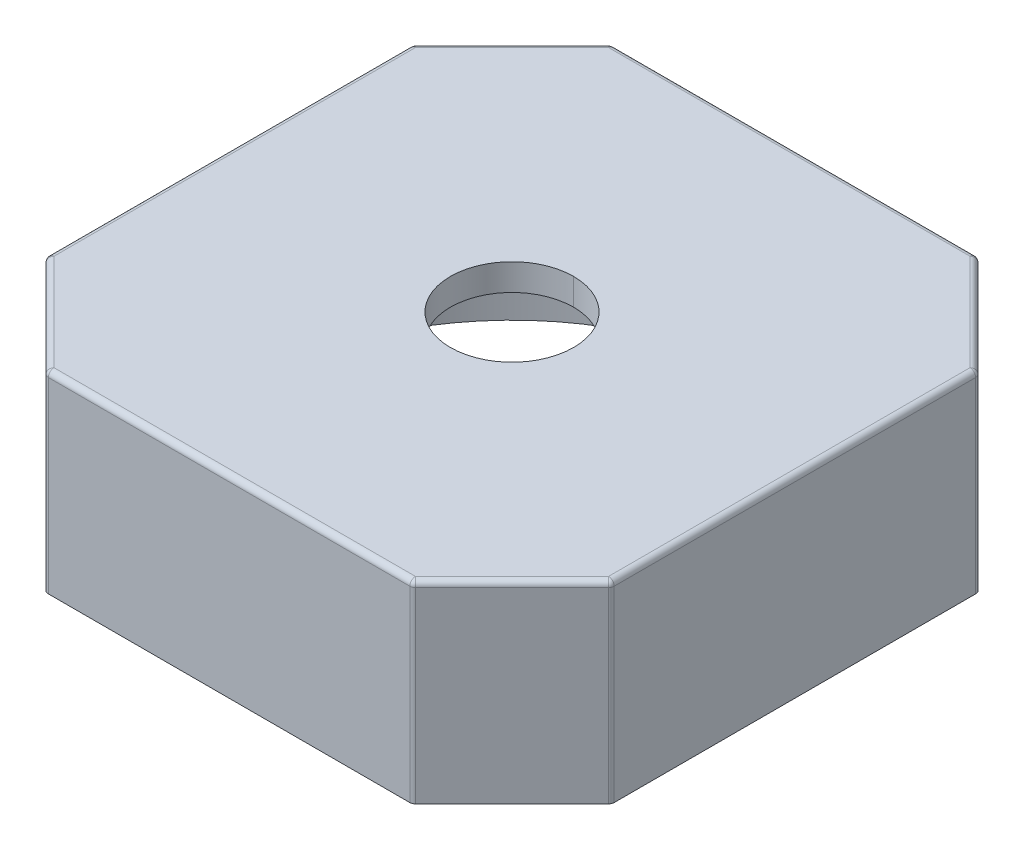
ISO-10303-21;
HEADER;
FILE_DESCRIPTION(('STEP AP214'),'2;1');
FILE_NAME('part.step','',(''),(''),'','','');
FILE_SCHEMA(('AUTOMOTIVE_DESIGN { 1 0 10303 214 1 1 1 1 }'));
ENDSEC;
DATA;
#1=APPLICATION_CONTEXT('core data for automotive mechanical design processes');
#2=APPLICATION_PROTOCOL_DEFINITION('international standard','automotive_design',2000,#1);
#3=PRODUCT_CONTEXT('',#1,'mechanical');
#4=PRODUCT('Part','Part','',(#3));
#5=PRODUCT_RELATED_PRODUCT_CATEGORY('part','',(#4));
#6=PRODUCT_DEFINITION_FORMATION('','',#4);
#7=PRODUCT_DEFINITION_CONTEXT('part definition',#1,'design');
#8=PRODUCT_DEFINITION('design','',#6,#7);
#9=PRODUCT_DEFINITION_SHAPE('','',#8);
#10=(LENGTH_UNIT() NAMED_UNIT(*) SI_UNIT(.MILLI.,.METRE.));
#11=(NAMED_UNIT(*) PLANE_ANGLE_UNIT() SI_UNIT($,.RADIAN.));
#12=(NAMED_UNIT(*) SI_UNIT($,.STERADIAN.) SOLID_ANGLE_UNIT());
#13=UNCERTAINTY_MEASURE_WITH_UNIT(LENGTH_MEASURE(1.E-05),#10,'distance_accuracy_value','');
#14=(GEOMETRIC_REPRESENTATION_CONTEXT(3) GLOBAL_UNCERTAINTY_ASSIGNED_CONTEXT((#13)) GLOBAL_UNIT_ASSIGNED_CONTEXT((#10,
#11,#12)) REPRESENTATION_CONTEXT('',''));
#15=CARTESIAN_POINT('',(0.,0.,0.));
#16=DIRECTION('',(0.,0.,1.));
#17=DIRECTION('',(1.,0.,0.));
#18=AXIS2_PLACEMENT_3D('',#15,#16,#17);
#19=CARTESIAN_POINT('',(0.,3.6,0.));
#20=DIRECTION('',(0.,-1.,0.));
#21=DIRECTION('',(1.,0.,0.));
#22=AXIS2_PLACEMENT_3D('',#19,#20,#21);
#23=CYLINDRICAL_SURFACE('',#22,3.95);
#24=CARTESIAN_POINT('',(0.,3.6,0.));
#25=DIRECTION('',(0.,-1.,0.));
#26=DIRECTION('',(1.,0.,0.));
#27=AXIS2_PLACEMENT_3D('',#24,#25,#26);
#28=CIRCLE('',#27,3.95);
#29=CARTESIAN_POINT('',(-3.95,3.6,0.));
#30=VERTEX_POINT('',#29);
#31=CARTESIAN_POINT('',(3.95,3.6,0.));
#32=VERTEX_POINT('',#31);
#33=EDGE_CURVE('E11',#30,#32,#28,.T.);
#34=ORIENTED_EDGE('',*,*,#33,.F.);
#35=DIRECTION('',(0.,-1.,0.));
#36=VECTOR('',#35,1.);
#37=CARTESIAN_POINT('',(-3.95,3.6,0.));
#38=LINE('',#37,#36);
#39=CARTESIAN_POINT('',(-3.95,1.1,0.));
#40=VERTEX_POINT('',#39);
#41=EDGE_CURVE('E24',#30,#40,#38,.T.);
#42=ORIENTED_EDGE('',*,*,#41,.T.);
#43=CARTESIAN_POINT('',(0.,1.1,0.));
#44=DIRECTION('',(0.,1.,0.));
#45=DIRECTION('',(1.,0.,0.));
#46=AXIS2_PLACEMENT_3D('',#43,#44,#45);
#47=CIRCLE('',#46,3.95);
#48=CARTESIAN_POINT('',(3.95,1.1,0.));
#49=VERTEX_POINT('',#48);
#50=EDGE_CURVE('E346',#49,#40,#47,.T.);
#51=ORIENTED_EDGE('',*,*,#50,.F.);
#52=DIRECTION('',(0.,-1.,0.));
#53=VECTOR('',#52,1.);
#54=CARTESIAN_POINT('',(3.95,3.6,0.));
#55=LINE('',#54,#53);
#56=EDGE_CURVE('E37',#32,#49,#55,.T.);
#57=ORIENTED_EDGE('',*,*,#56,.F.);
#58=EDGE_LOOP('',(#34,#42,#51,#57));
#59=FACE_BOUND('',#58,.T.);
#60=ADVANCED_FACE('F17',(#59),#23,.F.);
#61=CARTESIAN_POINT('',(0.,0.771572875253813,0.));
#62=DIRECTION('',(0.,1.,0.));
#63=DIRECTION('',(0.,0.,1.));
#64=AXIS2_PLACEMENT_3D('',#61,#62,#63);
#65=CYLINDRICAL_SURFACE('',#64,0.925000000000001);
#66=CARTESIAN_POINT('',(0.,3.6,0.));
#67=DIRECTION('',(0.,1.,0.));
#68=DIRECTION('',(0.,0.,-1.));
#69=AXIS2_PLACEMENT_3D('',#66,#67,#68);
#70=CIRCLE('',#69,0.925000000000001);
#71=CARTESIAN_POINT('',(0.,3.6,-0.92499999999999));
#72=VERTEX_POINT('',#71);
#73=CARTESIAN_POINT('',(0.,3.6,0.925000000000011));
#74=VERTEX_POINT('',#73);
#75=EDGE_CURVE('E342',#72,#74,#70,.T.);
#76=ORIENTED_EDGE('',*,*,#75,.F.);
#77=DIRECTION('',(0.,1.,0.));
#78=VECTOR('',#77,1.);
#79=CARTESIAN_POINT('',(0.,0.771572875253816,-0.924999999999999));
#80=LINE('',#79,#78);
#81=CARTESIAN_POINT('',(0.,4.,-0.924999999999988));
#82=VERTEX_POINT('',#81);
#83=EDGE_CURVE('E339',#72,#82,#80,.T.);
#84=ORIENTED_EDGE('',*,*,#83,.T.);
#85=CARTESIAN_POINT('',(0.,4.,0.));
#86=DIRECTION('',(0.,1.,0.));
#87=DIRECTION('',(0.,0.,1.));
#88=AXIS2_PLACEMENT_3D('',#85,#86,#87);
#89=CIRCLE('',#88,0.925000000000001);
#90=CARTESIAN_POINT('',(0.,4.,0.925000000000013));
#91=VERTEX_POINT('',#90);
#92=EDGE_CURVE('E336',#82,#91,#89,.T.);
#93=ORIENTED_EDGE('',*,*,#92,.T.);
#94=DIRECTION('',(0.,1.,0.));
#95=VECTOR('',#94,1.);
#96=CARTESIAN_POINT('',(0.,0.77157287525381,0.925000000000001));
#97=LINE('',#96,#95);
#98=EDGE_CURVE('E334',#74,#91,#97,.T.);
#99=ORIENTED_EDGE('',*,*,#98,.F.);
#100=EDGE_LOOP('',(#76,#84,#93,#99));
#101=FACE_BOUND('',#100,.T.);
#102=ADVANCED_FACE('F364',(#101),#65,.F.);
#103=CARTESIAN_POINT('',(0.,0.771572875253813,0.));
#104=DIRECTION('',(0.,1.,0.));
#105=DIRECTION('',(0.,0.,1.));
#106=AXIS2_PLACEMENT_3D('',#103,#104,#105);
#107=CYLINDRICAL_SURFACE('',#106,0.925000000000001);
#108=ORIENTED_EDGE('',*,*,#83,.F.);
#109=CARTESIAN_POINT('',(0.,3.6,0.));
#110=DIRECTION('',(0.,1.,0.));
#111=DIRECTION('',(0.,0.,-1.));
#112=AXIS2_PLACEMENT_3D('',#109,#110,#111);
#113=CIRCLE('',#112,0.925000000000001);
#114=EDGE_CURVE('E331',#74,#72,#113,.T.);
#115=ORIENTED_EDGE('',*,*,#114,.F.);
#116=ORIENTED_EDGE('',*,*,#98,.T.);
#117=CARTESIAN_POINT('',(0.,4.,0.));
#118=DIRECTION('',(0.,1.,0.));
#119=DIRECTION('',(0.,0.,1.));
#120=AXIS2_PLACEMENT_3D('',#117,#118,#119);
#121=CIRCLE('',#120,0.925000000000001);
#122=EDGE_CURVE('E328',#91,#82,#121,.T.);
#123=ORIENTED_EDGE('',*,*,#122,.T.);
#124=EDGE_LOOP('',(#108,#115,#116,#123));
#125=FACE_BOUND('',#124,.T.);
#126=ADVANCED_FACE('F368',(#125),#107,.F.);
#127=CARTESIAN_POINT('',(0.,3.6,0.));
#128=DIRECTION('',(0.,-1.,0.));
#129=DIRECTION('',(1.,0.,0.));
#130=AXIS2_PLACEMENT_3D('',#127,#128,#129);
#131=CYLINDRICAL_SURFACE('',#130,3.95);
#132=ORIENTED_EDGE('',*,*,#41,.F.);
#133=CARTESIAN_POINT('',(0.,3.6,0.));
#134=DIRECTION('',(0.,-1.,0.));
#135=DIRECTION('',(1.,0.,0.));
#136=AXIS2_PLACEMENT_3D('',#133,#134,#135);
#137=CIRCLE('',#136,3.95);
#138=EDGE_CURVE('E325',#32,#30,#137,.T.);
#139=ORIENTED_EDGE('',*,*,#138,.F.);
#140=ORIENTED_EDGE('',*,*,#56,.T.);
#141=CARTESIAN_POINT('',(0.,1.1,0.));
#142=DIRECTION('',(0.,1.,0.));
#143=DIRECTION('',(1.,0.,0.));
#144=AXIS2_PLACEMENT_3D('',#141,#142,#143);
#145=CIRCLE('',#144,3.95);
#146=EDGE_CURVE('E322',#40,#49,#145,.T.);
#147=ORIENTED_EDGE('',*,*,#146,.F.);
#148=EDGE_LOOP('',(#132,#139,#140,#147));
#149=FACE_BOUND('',#148,.T.);
#150=ADVANCED_FACE('F347',(#149),#131,.F.);
#151=CARTESIAN_POINT('',(0.,4.,0.));
#152=DIRECTION('',(0.,-1.,0.));
#153=DIRECTION('',(1.,0.,0.));
#154=AXIS2_PLACEMENT_3D('',#151,#152,#153);
#155=PLANE('',#154);
#156=DIRECTION('',(0.,0.,-1.));
#157=VECTOR('',#156,1.);
#158=CARTESIAN_POINT('',(4.165,4.,0.));
#159=LINE('',#158,#157);
#160=CARTESIAN_POINT('',(4.165,3.99999999999999,2.7147918471983));
#161=VERTEX_POINT('',#160);
#162=CARTESIAN_POINT('',(4.165,4.00000000000001,-2.71479184719828));
#163=VERTEX_POINT('',#162);
#164=EDGE_CURVE('E320',#161,#163,#159,.T.);
#165=ORIENTED_EDGE('',*,*,#164,.T.);
#166=DIRECTION('',(-0.707106781186548,0.,-0.707106781186547));
#167=VECTOR('',#166,1.);
#168=CARTESIAN_POINT('',(3.43989592359914,4.00000000000001,-3.43989592359913));
#169=LINE('',#168,#167);
#170=CARTESIAN_POINT('',(2.71479184719829,4.00000000000002,-4.16499999999999));
#171=VERTEX_POINT('',#170);
#172=EDGE_CURVE('E210',#163,#171,#169,.T.);
#173=ORIENTED_EDGE('',*,*,#172,.T.);
#174=DIRECTION('',(-1.,0.,0.));
#175=VECTOR('',#174,1.);
#176=CARTESIAN_POINT('',(0.,4.00000000000002,-4.16499999999999));
#177=LINE('',#176,#175);
#178=CARTESIAN_POINT('',(-2.71479184719828,4.00000000000002,-4.16499999999999));
#179=VERTEX_POINT('',#178);
#180=EDGE_CURVE('E317',#171,#179,#177,.T.);
#181=ORIENTED_EDGE('',*,*,#180,.T.);
#182=DIRECTION('',(-0.707106781186548,0.,0.707106781186547));
#183=VECTOR('',#182,1.);
#184=CARTESIAN_POINT('',(-3.43989592359914,4.00000000000001,-3.43989592359913));
#185=LINE('',#184,#183);
#186=CARTESIAN_POINT('',(-4.165,4.00000000000001,-2.71479184719827));
#187=VERTEX_POINT('',#186);
#188=EDGE_CURVE('E315',#179,#187,#185,.T.);
#189=ORIENTED_EDGE('',*,*,#188,.T.);
#190=DIRECTION('',(0.,0.,1.));
#191=VECTOR('',#190,1.);
#192=CARTESIAN_POINT('',(-4.165,4.,0.));
#193=LINE('',#192,#191);
#194=CARTESIAN_POINT('',(-4.165,3.99999999999999,2.7147918471983));
#195=VERTEX_POINT('',#194);
#196=EDGE_CURVE('E313',#187,#195,#193,.T.);
#197=ORIENTED_EDGE('',*,*,#196,.T.);
#198=DIRECTION('',(0.707106781186548,0.,0.707106781186547));
#199=VECTOR('',#198,1.);
#200=CARTESIAN_POINT('',(-3.43989592359914,3.99999999999999,3.43989592359916));
#201=LINE('',#200,#199);
#202=CARTESIAN_POINT('',(-2.71479184719829,3.99999999999999,4.16500000000001));
#203=VERTEX_POINT('',#202);
#204=EDGE_CURVE('E311',#195,#203,#201,.T.);
#205=ORIENTED_EDGE('',*,*,#204,.T.);
#206=DIRECTION('',(1.,0.,0.));
#207=VECTOR('',#206,1.);
#208=CARTESIAN_POINT('',(0.,3.99999999999999,4.16500000000001));
#209=LINE('',#208,#207);
#210=CARTESIAN_POINT('',(2.71479184719829,3.99999999999999,4.16500000000001));
#211=VERTEX_POINT('',#210);
#212=EDGE_CURVE('E309',#203,#211,#209,.T.);
#213=ORIENTED_EDGE('',*,*,#212,.T.);
#214=DIRECTION('',(0.707106781186548,0.,-0.707106781186547));
#215=VECTOR('',#214,1.);
#216=CARTESIAN_POINT('',(3.43989592359914,3.99999999999999,3.43989592359916));
#217=LINE('',#216,#215);
#218=EDGE_CURVE('E306',#211,#161,#217,.T.);
#219=ORIENTED_EDGE('',*,*,#218,.T.);
#220=EDGE_LOOP('',(#165,#173,#181,#189,#197,#205,#213,#219));
#221=FACE_BOUND('',#220,.T.);
#222=ORIENTED_EDGE('',*,*,#122,.F.);
#223=ORIENTED_EDGE('',*,*,#92,.F.);
#224=EDGE_LOOP('',(#222,#223));
#225=FACE_BOUND('',#224,.T.);
#226=ADVANCED_FACE('F379',(#221,#225),#155,.F.);
#227=CARTESIAN_POINT('',(-2.75,1.10000000000002,-4.25));
#228=DIRECTION('',(0.,0.,1.));
#229=DIRECTION('',(0.,-1.,0.));
#230=AXIS2_PLACEMENT_3D('',#227,#228,#229);
#231=PLANE('',#230);
#232=DIRECTION('',(1.,0.,0.));
#233=VECTOR('',#232,1.);
#234=CARTESIAN_POINT('',(-2.75,1.10000000000002,-4.25));
#235=LINE('',#234,#233);
#236=CARTESIAN_POINT('',(-2.71479184719828,1.10000000000002,-4.25));
#237=VERTEX_POINT('',#236);
#238=CARTESIAN_POINT('',(2.71479184719829,1.10000000000002,-4.25));
#239=VERTEX_POINT('',#238);
#240=EDGE_CURVE('E304',#237,#239,#235,.T.);
#241=ORIENTED_EDGE('',*,*,#240,.F.);
#242=DIRECTION('',(0.,1.,0.));
#243=VECTOR('',#242,1.);
#244=CARTESIAN_POINT('',(-2.71479184719828,1.10000000000002,-4.25));
#245=LINE('',#244,#243);
#246=CARTESIAN_POINT('',(-2.71479184719828,3.91500000000002,-4.24999999999999));
#247=VERTEX_POINT('',#246);
#248=EDGE_CURVE('E302',#237,#247,#245,.T.);
#249=ORIENTED_EDGE('',*,*,#248,.T.);
#250=DIRECTION('',(1.,0.,0.));
#251=VECTOR('',#250,1.);
#252=CARTESIAN_POINT('',(-2.75,3.91500000000002,-4.24999999999999));
#253=LINE('',#252,#251);
#254=CARTESIAN_POINT('',(2.71479184719829,3.91500000000002,-4.24999999999999));
#255=VERTEX_POINT('',#254);
#256=EDGE_CURVE('E300',#247,#255,#253,.T.);
#257=ORIENTED_EDGE('',*,*,#256,.T.);
#258=DIRECTION('',(0.,-1.,0.));
#259=VECTOR('',#258,1.);
#260=CARTESIAN_POINT('',(2.71479184719829,1.10000000000002,-4.25));
#261=LINE('',#260,#259);
#262=EDGE_CURVE('E297',#255,#239,#261,.T.);
#263=ORIENTED_EDGE('',*,*,#262,.T.);
#264=EDGE_LOOP('',(#241,#249,#257,#263));
#265=FACE_BOUND('',#264,.T.);
#266=ADVANCED_FACE('F382',(#265),#231,.F.);
#267=CARTESIAN_POINT('',(-4.25,1.10000000000001,-2.75));
#268=DIRECTION('',(0.707106781186547,0.,0.707106781186548));
#269=DIRECTION('',(-0.707106781186548,0.,0.707106781186547));
#270=AXIS2_PLACEMENT_3D('',#267,#268,#269);
#271=PLANE('',#270);
#272=DIRECTION('',(0.707106781186548,0.,-0.707106781186547));
#273=VECTOR('',#272,1.);
#274=CARTESIAN_POINT('',(-4.25,1.10000000000001,-2.75));
#275=LINE('',#274,#273);
#276=CARTESIAN_POINT('',(-4.22510407640086,1.10000000000001,-2.77489592359914));
#277=VERTEX_POINT('',#276);
#278=CARTESIAN_POINT('',(-2.77489592359914,1.10000000000002,-4.22510407640086));
#279=VERTEX_POINT('',#278);
#280=EDGE_CURVE('E295',#277,#279,#275,.T.);
#281=ORIENTED_EDGE('',*,*,#280,.F.);
#282=DIRECTION('',(0.,1.,0.));
#283=VECTOR('',#282,1.);
#284=CARTESIAN_POINT('',(-4.22510407640086,1.10000000000001,-2.77489592359914));
#285=LINE('',#284,#283);
#286=CARTESIAN_POINT('',(-4.22510407640086,3.91500000000001,-2.77489592359913));
#287=VERTEX_POINT('',#286);
#288=EDGE_CURVE('E293',#277,#287,#285,.T.);
#289=ORIENTED_EDGE('',*,*,#288,.T.);
#290=DIRECTION('',(0.707106781186548,0.,-0.707106781186547));
#291=VECTOR('',#290,1.);
#292=CARTESIAN_POINT('',(-4.25,3.91500000000001,-2.74999999999999));
#293=LINE('',#292,#291);
#294=CARTESIAN_POINT('',(-2.77489592359914,3.91500000000002,-4.22510407640085));
#295=VERTEX_POINT('',#294);
#296=EDGE_CURVE('E291',#287,#295,#293,.T.);
#297=ORIENTED_EDGE('',*,*,#296,.T.);
#298=DIRECTION('',(0.,-1.,0.));
#299=VECTOR('',#298,1.);
#300=CARTESIAN_POINT('',(-2.77489592359914,1.10000000000002,-4.22510407640086));
#301=LINE('',#300,#299);
#302=EDGE_CURVE('E288',#295,#279,#301,.T.);
#303=ORIENTED_EDGE('',*,*,#302,.T.);
#304=EDGE_LOOP('',(#281,#289,#297,#303));
#305=FACE_BOUND('',#304,.T.);
#306=ADVANCED_FACE('F386',(#305),#271,.F.);
#307=CARTESIAN_POINT('',(-4.25,1.09999999999999,2.75));
#308=DIRECTION('',(1.,0.,0.));
#309=DIRECTION('',(0.,0.,1.));
#310=AXIS2_PLACEMENT_3D('',#307,#308,#309);
#311=PLANE('',#310);
#312=DIRECTION('',(0.,0.,-1.));
#313=VECTOR('',#312,1.);
#314=CARTESIAN_POINT('',(-4.25,1.09999999999999,2.75));
#315=LINE('',#314,#313);
#316=CARTESIAN_POINT('',(-4.25,1.09999999999999,2.71479184719829));
#317=VERTEX_POINT('',#316);
#318=CARTESIAN_POINT('',(-4.25,1.10000000000001,-2.71479184719828));
#319=VERTEX_POINT('',#318);
#320=EDGE_CURVE('E286',#317,#319,#315,.T.);
#321=ORIENTED_EDGE('',*,*,#320,.F.);
#322=DIRECTION('',(0.,1.,0.));
#323=VECTOR('',#322,1.);
#324=CARTESIAN_POINT('',(-4.25,1.09999999999999,2.71479184719829));
#325=LINE('',#324,#323);
#326=CARTESIAN_POINT('',(-4.25,3.91499999999999,2.7147918471983));
#327=VERTEX_POINT('',#326);
#328=EDGE_CURVE('E284',#317,#327,#325,.T.);
#329=ORIENTED_EDGE('',*,*,#328,.T.);
#330=DIRECTION('',(0.,0.,-1.));
#331=VECTOR('',#330,1.);
#332=CARTESIAN_POINT('',(-4.25,3.91499999999999,2.75000000000001));
#333=LINE('',#332,#331);
#334=CARTESIAN_POINT('',(-4.25,3.91500000000001,-2.71479184719828));
#335=VERTEX_POINT('',#334);
#336=EDGE_CURVE('E282',#327,#335,#333,.T.);
#337=ORIENTED_EDGE('',*,*,#336,.T.);
#338=DIRECTION('',(0.,-1.,0.));
#339=VECTOR('',#338,1.);
#340=CARTESIAN_POINT('',(-4.25,1.10000000000001,-2.71479184719828));
#341=LINE('',#340,#339);
#342=EDGE_CURVE('E279',#335,#319,#341,.T.);
#343=ORIENTED_EDGE('',*,*,#342,.T.);
#344=EDGE_LOOP('',(#321,#329,#337,#343));
#345=FACE_BOUND('',#344,.T.);
#346=ADVANCED_FACE('F390',(#345),#311,.F.);
#347=CARTESIAN_POINT('',(-2.75,1.09999999999999,4.25));
#348=DIRECTION('',(0.707106781186547,0.,-0.707106781186548));
#349=DIRECTION('',(0.707106781186548,0.,0.707106781186547));
#350=AXIS2_PLACEMENT_3D('',#347,#348,#349);
#351=PLANE('',#350);
#352=DIRECTION('',(-0.707106781186548,0.,-0.707106781186547));
#353=VECTOR('',#352,1.);
#354=CARTESIAN_POINT('',(-2.75,3.91499999999999,4.25000000000001));
#355=LINE('',#354,#353);
#356=CARTESIAN_POINT('',(-2.77489592359914,3.91499999999999,4.22510407640087));
#357=VERTEX_POINT('',#356);
#358=CARTESIAN_POINT('',(-4.22510407640086,3.91499999999999,2.77489592359916));
#359=VERTEX_POINT('',#358);
#360=EDGE_CURVE('E277',#357,#359,#355,.T.);
#361=ORIENTED_EDGE('',*,*,#360,.T.);
#362=DIRECTION('',(0.,-1.,0.));
#363=VECTOR('',#362,1.);
#364=CARTESIAN_POINT('',(-4.22510407640086,1.09999999999999,2.77489592359915));
#365=LINE('',#364,#363);
#366=CARTESIAN_POINT('',(-4.22510407640086,1.09999999999999,2.77489592359915));
#367=VERTEX_POINT('',#366);
#368=EDGE_CURVE('E275',#359,#367,#365,.T.);
#369=ORIENTED_EDGE('',*,*,#368,.T.);
#370=DIRECTION('',(-0.707106781186548,0.,-0.707106781186547));
#371=VECTOR('',#370,1.);
#372=CARTESIAN_POINT('',(-2.75,1.09999999999999,4.25));
#373=LINE('',#372,#371);
#374=CARTESIAN_POINT('',(-2.77489592359915,1.09999999999999,4.22510407640086));
#375=VERTEX_POINT('',#374);
#376=EDGE_CURVE('E272',#375,#367,#373,.T.);
#377=ORIENTED_EDGE('',*,*,#376,.F.);
#378=DIRECTION('',(0.,1.,0.));
#379=VECTOR('',#378,1.);
#380=CARTESIAN_POINT('',(-2.77489592359914,1.09999999999999,4.22510407640086));
#381=LINE('',#380,#379);
#382=EDGE_CURVE('E269',#375,#357,#381,.T.);
#383=ORIENTED_EDGE('',*,*,#382,.T.);
#384=EDGE_LOOP('',(#361,#369,#377,#383));
#385=FACE_BOUND('',#384,.T.);
#386=ADVANCED_FACE('F394',(#385),#351,.F.);
#387=CARTESIAN_POINT('',(2.75,1.09999999999999,4.25));
#388=DIRECTION('',(0.,0.,-1.));
#389=DIRECTION('',(0.,1.,0.));
#390=AXIS2_PLACEMENT_3D('',#387,#388,#389);
#391=PLANE('',#390);
#392=DIRECTION('',(-1.,0.,0.));
#393=VECTOR('',#392,1.);
#394=CARTESIAN_POINT('',(2.75,1.09999999999999,4.25));
#395=LINE('',#394,#393);
#396=CARTESIAN_POINT('',(2.71479184719828,1.09999999999999,4.25));
#397=VERTEX_POINT('',#396);
#398=CARTESIAN_POINT('',(-2.71479184719829,1.09999999999999,4.25));
#399=VERTEX_POINT('',#398);
#400=EDGE_CURVE('E267',#397,#399,#395,.T.);
#401=ORIENTED_EDGE('',*,*,#400,.F.);
#402=DIRECTION('',(0.,1.,0.));
#403=VECTOR('',#402,1.);
#404=CARTESIAN_POINT('',(2.71479184719828,1.09999999999999,4.25));
#405=LINE('',#404,#403);
#406=CARTESIAN_POINT('',(2.71479184719828,3.91499999999999,4.25000000000001));
#407=VERTEX_POINT('',#406);
#408=EDGE_CURVE('E265',#397,#407,#405,.T.);
#409=ORIENTED_EDGE('',*,*,#408,.T.);
#410=DIRECTION('',(-1.,0.,0.));
#411=VECTOR('',#410,1.);
#412=CARTESIAN_POINT('',(2.75,3.91499999999999,4.25000000000001));
#413=LINE('',#412,#411);
#414=CARTESIAN_POINT('',(-2.71479184719829,3.91499999999999,4.25000000000001));
#415=VERTEX_POINT('',#414);
#416=EDGE_CURVE('E263',#407,#415,#413,.T.);
#417=ORIENTED_EDGE('',*,*,#416,.T.);
#418=DIRECTION('',(0.,-1.,0.));
#419=VECTOR('',#418,1.);
#420=CARTESIAN_POINT('',(-2.71479184719829,1.09999999999999,4.25));
#421=LINE('',#420,#419);
#422=EDGE_CURVE('E260',#415,#399,#421,.T.);
#423=ORIENTED_EDGE('',*,*,#422,.T.);
#424=EDGE_LOOP('',(#401,#409,#417,#423));
#425=FACE_BOUND('',#424,.T.);
#426=ADVANCED_FACE('F398',(#425),#391,.F.);
#427=CARTESIAN_POINT('',(4.25,1.09999999999999,2.75));
#428=DIRECTION('',(-0.707106781186547,0.,-0.707106781186548));
#429=DIRECTION('',(0.707106781186548,0.,-0.707106781186547));
#430=AXIS2_PLACEMENT_3D('',#427,#428,#429);
#431=PLANE('',#430);
#432=DIRECTION('',(-0.707106781186548,0.,0.707106781186547));
#433=VECTOR('',#432,1.);
#434=CARTESIAN_POINT('',(4.25,1.09999999999999,2.75));
#435=LINE('',#434,#433);
#436=CARTESIAN_POINT('',(4.22510407640086,1.09999999999999,2.77489592359915));
#437=VERTEX_POINT('',#436);
#438=CARTESIAN_POINT('',(2.77489592359914,1.09999999999999,4.22510407640086));
#439=VERTEX_POINT('',#438);
#440=EDGE_CURVE('E258',#437,#439,#435,.T.);
#441=ORIENTED_EDGE('',*,*,#440,.F.);
#442=DIRECTION('',(0.,1.,0.));
#443=VECTOR('',#442,1.);
#444=CARTESIAN_POINT('',(4.22510407640086,1.09999999999999,2.77489592359915));
#445=LINE('',#444,#443);
#446=CARTESIAN_POINT('',(4.22510407640086,3.91499999999999,2.77489592359916));
#447=VERTEX_POINT('',#446);
#448=EDGE_CURVE('E256',#437,#447,#445,.T.);
#449=ORIENTED_EDGE('',*,*,#448,.T.);
#450=DIRECTION('',(-0.707106781186548,0.,0.707106781186547));
#451=VECTOR('',#450,1.);
#452=CARTESIAN_POINT('',(4.25,3.91499999999999,2.75000000000001));
#453=LINE('',#452,#451);
#454=CARTESIAN_POINT('',(2.77489592359914,3.91499999999999,4.22510407640087));
#455=VERTEX_POINT('',#454);
#456=EDGE_CURVE('E254',#447,#455,#453,.T.);
#457=ORIENTED_EDGE('',*,*,#456,.T.);
#458=DIRECTION('',(0.,-1.,0.));
#459=VECTOR('',#458,1.);
#460=CARTESIAN_POINT('',(2.77489592359914,1.09999999999999,4.22510407640086));
#461=LINE('',#460,#459);
#462=EDGE_CURVE('E251',#455,#439,#461,.T.);
#463=ORIENTED_EDGE('',*,*,#462,.T.);
#464=EDGE_LOOP('',(#441,#449,#457,#463));
#465=FACE_BOUND('',#464,.T.);
#466=ADVANCED_FACE('F402',(#465),#431,.F.);
#467=CARTESIAN_POINT('',(4.25,1.10000000000001,-2.75));
#468=DIRECTION('',(-1.,0.,0.));
#469=DIRECTION('',(0.,0.,-1.));
#470=AXIS2_PLACEMENT_3D('',#467,#468,#469);
#471=PLANE('',#470);
#472=DIRECTION('',(0.,0.,1.));
#473=VECTOR('',#472,1.);
#474=CARTESIAN_POINT('',(4.25,1.10000000000001,-2.75));
#475=LINE('',#474,#473);
#476=CARTESIAN_POINT('',(4.25,1.10000000000001,-2.71479184719829));
#477=VERTEX_POINT('',#476);
#478=CARTESIAN_POINT('',(4.25,1.09999999999999,2.71479184719829));
#479=VERTEX_POINT('',#478);
#480=EDGE_CURVE('E249',#477,#479,#475,.T.);
#481=ORIENTED_EDGE('',*,*,#480,.F.);
#482=DIRECTION('',(0.,1.,0.));
#483=VECTOR('',#482,1.);
#484=CARTESIAN_POINT('',(4.25,1.10000000000001,-2.71479184719829));
#485=LINE('',#484,#483);
#486=CARTESIAN_POINT('',(4.25,3.91500000000001,-2.71479184719828));
#487=VERTEX_POINT('',#486);
#488=EDGE_CURVE('E247',#477,#487,#485,.T.);
#489=ORIENTED_EDGE('',*,*,#488,.T.);
#490=DIRECTION('',(0.,0.,1.));
#491=VECTOR('',#490,1.);
#492=CARTESIAN_POINT('',(4.25,3.91500000000001,-2.74999999999999));
#493=LINE('',#492,#491);
#494=CARTESIAN_POINT('',(4.25,3.91499999999999,2.7147918471983));
#495=VERTEX_POINT('',#494);
#496=EDGE_CURVE('E245',#487,#495,#493,.T.);
#497=ORIENTED_EDGE('',*,*,#496,.T.);
#498=DIRECTION('',(0.,-1.,0.));
#499=VECTOR('',#498,1.);
#500=CARTESIAN_POINT('',(4.25,1.09999999999999,2.71479184719829));
#501=LINE('',#500,#499);
#502=EDGE_CURVE('E242',#495,#479,#501,.T.);
#503=ORIENTED_EDGE('',*,*,#502,.T.);
#504=EDGE_LOOP('',(#481,#489,#497,#503));
#505=FACE_BOUND('',#504,.T.);
#506=ADVANCED_FACE('F361',(#505),#471,.F.);
#507=CARTESIAN_POINT('',(2.75,1.10000000000002,-4.25));
#508=DIRECTION('',(-0.707106781186547,0.,0.707106781186548));
#509=DIRECTION('',(-0.707106781186548,0.,-0.707106781186547));
#510=AXIS2_PLACEMENT_3D('',#507,#508,#509);
#511=PLANE('',#510);
#512=DIRECTION('',(0.707106781186548,0.,0.707106781186547));
#513=VECTOR('',#512,1.);
#514=CARTESIAN_POINT('',(2.75,1.10000000000002,-4.25));
#515=LINE('',#514,#513);
#516=CARTESIAN_POINT('',(2.77489592359915,1.10000000000002,-4.22510407640086));
#517=VERTEX_POINT('',#516);
#518=CARTESIAN_POINT('',(4.22510407640086,1.10000000000001,-2.77489592359915));
#519=VERTEX_POINT('',#518);
#520=EDGE_CURVE('E240',#517,#519,#515,.T.);
#521=ORIENTED_EDGE('',*,*,#520,.F.);
#522=DIRECTION('',(0.,1.,0.));
#523=VECTOR('',#522,1.);
#524=CARTESIAN_POINT('',(2.77489592359915,1.10000000000002,-4.22510407640086));
#525=LINE('',#524,#523);
#526=CARTESIAN_POINT('',(2.77489592359915,3.91500000000002,-4.22510407640085));
#527=VERTEX_POINT('',#526);
#528=EDGE_CURVE('E183',#517,#527,#525,.T.);
#529=ORIENTED_EDGE('',*,*,#528,.T.);
#530=DIRECTION('',(0.707106781186548,0.,0.707106781186547));
#531=VECTOR('',#530,1.);
#532=CARTESIAN_POINT('',(2.75,3.91500000000002,-4.24999999999999));
#533=LINE('',#532,#531);
#534=CARTESIAN_POINT('',(4.22510407640086,3.91500000000001,-2.77489592359913));
#535=VERTEX_POINT('',#534);
#536=EDGE_CURVE('E177',#527,#535,#533,.T.);
#537=ORIENTED_EDGE('',*,*,#536,.T.);
#538=DIRECTION('',(0.,-1.,0.));
#539=VECTOR('',#538,1.);
#540=CARTESIAN_POINT('',(4.22510407640086,1.10000000000001,-2.77489592359915));
#541=LINE('',#540,#539);
#542=EDGE_CURVE('E180',#535,#519,#541,.T.);
#543=ORIENTED_EDGE('',*,*,#542,.T.);
#544=EDGE_LOOP('',(#521,#529,#537,#543));
#545=FACE_BOUND('',#544,.T.);
#546=ADVANCED_FACE('F179',(#545),#511,.F.);
#547=CARTESIAN_POINT('',(0.,1.1,0.));
#548=DIRECTION('',(0.,-1.,0.));
#549=DIRECTION('',(1.,0.,0.));
#550=AXIS2_PLACEMENT_3D('',#547,#548,#549);
#551=PLANE('',#550);
#552=ORIENTED_EDGE('',*,*,#376,.T.);
#553=CARTESIAN_POINT('',(-4.165,1.09999999999999,2.71479184719829));
#554=DIRECTION('',(0.,-1.,0.));
#555=DIRECTION('',(0.,0.,-1.));
#556=AXIS2_PLACEMENT_3D('',#553,#554,#555);
#557=CIRCLE('',#556,0.085);
#558=EDGE_CURVE('E198',#367,#317,#557,.T.);
#559=ORIENTED_EDGE('',*,*,#558,.T.);
#560=ORIENTED_EDGE('',*,*,#320,.T.);
#561=CARTESIAN_POINT('',(-4.165,1.10000000000001,-2.71479184719828));
#562=DIRECTION('',(0.,-1.,0.));
#563=DIRECTION('',(0.,0.,-1.));
#564=AXIS2_PLACEMENT_3D('',#561,#562,#563);
#565=CIRCLE('',#564,0.085);
#566=EDGE_CURVE('E234',#319,#277,#565,.T.);
#567=ORIENTED_EDGE('',*,*,#566,.T.);
#568=ORIENTED_EDGE('',*,*,#280,.T.);
#569=CARTESIAN_POINT('',(-2.71479184719828,1.10000000000001,-4.165));
#570=DIRECTION('',(0.,-1.,0.));
#571=DIRECTION('',(0.,0.,-1.));
#572=AXIS2_PLACEMENT_3D('',#569,#570,#571);
#573=CIRCLE('',#572,0.085);
#574=EDGE_CURVE('E231',#279,#237,#573,.T.);
#575=ORIENTED_EDGE('',*,*,#574,.T.);
#576=ORIENTED_EDGE('',*,*,#240,.T.);
#577=CARTESIAN_POINT('',(2.71479184719829,1.10000000000001,-4.165));
#578=DIRECTION('',(0.,-1.,0.));
#579=DIRECTION('',(0.,0.,-1.));
#580=AXIS2_PLACEMENT_3D('',#577,#578,#579);
#581=CIRCLE('',#580,0.085);
#582=EDGE_CURVE('E228',#239,#517,#581,.T.);
#583=ORIENTED_EDGE('',*,*,#582,.T.);
#584=ORIENTED_EDGE('',*,*,#520,.T.);
#585=CARTESIAN_POINT('',(4.165,1.10000000000001,-2.71479184719829));
#586=DIRECTION('',(0.,-1.,0.));
#587=DIRECTION('',(0.,0.,-1.));
#588=AXIS2_PLACEMENT_3D('',#585,#586,#587);
#589=CIRCLE('',#588,0.085);
#590=EDGE_CURVE('E197',#519,#477,#589,.T.);
#591=ORIENTED_EDGE('',*,*,#590,.T.);
#592=ORIENTED_EDGE('',*,*,#480,.T.);
#593=CARTESIAN_POINT('',(4.165,1.09999999999999,2.71479184719829));
#594=DIRECTION('',(0.,-1.,0.));
#595=DIRECTION('',(0.,0.,-1.));
#596=AXIS2_PLACEMENT_3D('',#593,#594,#595);
#597=CIRCLE('',#596,0.085);
#598=EDGE_CURVE('E224',#479,#437,#597,.T.);
#599=ORIENTED_EDGE('',*,*,#598,.T.);
#600=ORIENTED_EDGE('',*,*,#440,.T.);
#601=CARTESIAN_POINT('',(2.71479184719828,1.09999999999999,4.165));
#602=DIRECTION('',(0.,-1.,0.));
#603=DIRECTION('',(0.,0.,-1.));
#604=AXIS2_PLACEMENT_3D('',#601,#602,#603);
#605=CIRCLE('',#604,0.085);
#606=EDGE_CURVE('E221',#439,#397,#605,.T.);
#607=ORIENTED_EDGE('',*,*,#606,.T.);
#608=ORIENTED_EDGE('',*,*,#400,.T.);
#609=CARTESIAN_POINT('',(-2.71479184719829,1.09999999999999,4.165));
#610=DIRECTION('',(0.,-1.,0.));
#611=DIRECTION('',(0.,0.,-1.));
#612=AXIS2_PLACEMENT_3D('',#609,#610,#611);
#613=CIRCLE('',#612,0.085);
#614=EDGE_CURVE('E206',#399,#375,#613,.T.);
#615=ORIENTED_EDGE('',*,*,#614,.T.);
#616=EDGE_LOOP('',(#552,#559,#560,#567,#568,#575,#576,#583,#584,#591,#592,#599,#600,#607,#608,#615));
#617=FACE_BOUND('',#616,.T.);
#618=ORIENTED_EDGE('',*,*,#50,.T.);
#619=ORIENTED_EDGE('',*,*,#146,.T.);
#620=EDGE_LOOP('',(#618,#619));
#621=FACE_BOUND('',#620,.T.);
#622=ADVANCED_FACE('F349',(#617,#621),#551,.T.);
#623=CARTESIAN_POINT('',(0.,3.6,0.));
#624=DIRECTION('',(0.,-1.,0.));
#625=DIRECTION('',(1.,0.,0.));
#626=AXIS2_PLACEMENT_3D('',#623,#624,#625);
#627=PLANE('',#626);
#628=ORIENTED_EDGE('',*,*,#138,.T.);
#629=ORIENTED_EDGE('',*,*,#33,.T.);
#630=EDGE_LOOP('',(#628,#629));
#631=FACE_BOUND('',#630,.T.);
#632=ORIENTED_EDGE('',*,*,#114,.T.);
#633=ORIENTED_EDGE('',*,*,#75,.T.);
#634=EDGE_LOOP('',(#632,#633));
#635=FACE_BOUND('',#634,.T.);
#636=ADVANCED_FACE('F351',(#631,#635),#627,.T.);
#637=CARTESIAN_POINT('',(4.165,1.10000000000001,-2.71479184719829));
#638=DIRECTION('',(0.,-1.,0.));
#639=DIRECTION('',(0.,0.,-1.));
#640=AXIS2_PLACEMENT_3D('',#637,#638,#639);
#641=CYLINDRICAL_SURFACE('',#640,0.085);
#642=CARTESIAN_POINT('',(4.165,3.91500000000001,-2.71479184719828));
#643=DIRECTION('',(0.,1.,0.));
#644=DIRECTION('',(0.,0.,1.));
#645=AXIS2_PLACEMENT_3D('',#642,#643,#644);
#646=CIRCLE('',#645,0.085);
#647=EDGE_CURVE('E194',#487,#535,#646,.T.);
#648=ORIENTED_EDGE('',*,*,#647,.F.);
#649=ORIENTED_EDGE('',*,*,#488,.F.);
#650=ORIENTED_EDGE('',*,*,#590,.F.);
#651=ORIENTED_EDGE('',*,*,#542,.F.);
#652=EDGE_LOOP('',(#648,#649,#650,#651));
#653=FACE_BOUND('',#652,.T.);
#654=ADVANCED_FACE('F192',(#653),#641,.T.);
#655=CARTESIAN_POINT('',(4.165,3.91500000000001,-2.71479184719828));
#656=DIRECTION('',(0.,0.,-1.));
#657=DIRECTION('',(1.,0.,0.));
#658=AXIS2_PLACEMENT_3D('',#655,#656,#657);
#659=SPHERICAL_SURFACE('',#658,0.085);
#660=CARTESIAN_POINT('',(4.165,3.91500000000001,-2.71479184719828));
#661=DIRECTION('',(0.,0.,1.));
#662=DIRECTION('',(-1.,0.,0.));
#663=AXIS2_PLACEMENT_3D('',#660,#661,#662);
#664=CIRCLE('',#663,0.085);
#665=EDGE_CURVE('E205',#487,#163,#664,.T.);
#666=ORIENTED_EDGE('',*,*,#665,.F.);
#667=ORIENTED_EDGE('',*,*,#647,.T.);
#668=CARTESIAN_POINT('',(4.165,3.91500000000001,-2.71479184719828));
#669=DIRECTION('',(-0.70710678118655,0.,-0.707106781186545));
#670=DIRECTION('',(0.707106781186545,0.,-0.70710678118655));
#671=AXIS2_PLACEMENT_3D('',#668,#669,#670);
#672=CIRCLE('',#671,0.0849999999999998);
#673=EDGE_CURVE('E203',#163,#535,#672,.T.);
#674=ORIENTED_EDGE('',*,*,#673,.F.);
#675=EDGE_LOOP('',(#666,#667,#674));
#676=FACE_BOUND('',#675,.T.);
#677=ADVANCED_FACE('F202',(#676),#659,.T.);
#678=CARTESIAN_POINT('',(2.71479184719829,1.10000000000001,-4.165));
#679=DIRECTION('',(0.,1.,0.));
#680=DIRECTION('',(0.,0.,1.));
#681=AXIS2_PLACEMENT_3D('',#678,#679,#680);
#682=CYLINDRICAL_SURFACE('',#681,0.085);
#683=ORIENTED_EDGE('',*,*,#582,.F.);
#684=ORIENTED_EDGE('',*,*,#262,.F.);
#685=CARTESIAN_POINT('',(2.71479184719829,3.91500000000002,-4.16499999999999));
#686=DIRECTION('',(0.,1.,0.));
#687=DIRECTION('',(0.,0.,1.));
#688=AXIS2_PLACEMENT_3D('',#685,#686,#687);
#689=CIRCLE('',#688,0.085);
#690=EDGE_CURVE('E211',#527,#255,#689,.T.);
#691=ORIENTED_EDGE('',*,*,#690,.F.);
#692=ORIENTED_EDGE('',*,*,#528,.F.);
#693=EDGE_LOOP('',(#683,#684,#691,#692));
#694=FACE_BOUND('',#693,.T.);
#695=ADVANCED_FACE('F416',(#694),#682,.T.);
#696=CARTESIAN_POINT('',(2.68989592359914,3.91500000000002,-4.18989592359913));
#697=DIRECTION('',(0.707106781186548,0.,0.707106781186547));
#698=DIRECTION('',(0.707106781186547,0.,-0.707106781186548));
#699=AXIS2_PLACEMENT_3D('',#696,#697,#698);
#700=CYLINDRICAL_SURFACE('',#699,0.0849999999999995);
#701=ORIENTED_EDGE('',*,*,#673,.T.);
#702=ORIENTED_EDGE('',*,*,#536,.F.);
#703=CARTESIAN_POINT('',(2.71479184719829,3.91500000000002,-4.16499999999999));
#704=DIRECTION('',(-0.707106781186542,0.,-0.707106781186553));
#705=DIRECTION('',(-0.707106781186553,0.,0.707106781186542));
#706=AXIS2_PLACEMENT_3D('',#703,#704,#705);
#707=CIRCLE('',#706,0.0850000000000001);
#708=EDGE_CURVE('E215',#171,#527,#707,.T.);
#709=ORIENTED_EDGE('',*,*,#708,.F.);
#710=ORIENTED_EDGE('',*,*,#172,.F.);
#711=EDGE_LOOP('',(#701,#702,#709,#710));
#712=FACE_BOUND('',#711,.T.);
#713=ADVANCED_FACE('F209',(#712),#700,.T.);
#714=CARTESIAN_POINT('',(4.165,3.91500000000001,-2.74999999999999));
#715=DIRECTION('',(0.,0.,1.));
#716=DIRECTION('',(0.,-1.,0.));
#717=AXIS2_PLACEMENT_3D('',#714,#715,#716);
#718=CYLINDRICAL_SURFACE('',#717,0.085);
#719=ORIENTED_EDGE('',*,*,#665,.T.);
#720=ORIENTED_EDGE('',*,*,#164,.F.);
#721=CARTESIAN_POINT('',(4.165,3.91499999999999,2.7147918471983));
#722=DIRECTION('',(0.,0.,1.));
#723=DIRECTION('',(0.,-1.,0.));
#724=AXIS2_PLACEMENT_3D('',#721,#722,#723);
#725=CIRCLE('',#724,0.085);
#726=EDGE_CURVE('E424',#495,#161,#725,.T.);
#727=ORIENTED_EDGE('',*,*,#726,.F.);
#728=ORIENTED_EDGE('',*,*,#496,.F.);
#729=EDGE_LOOP('',(#719,#720,#727,#728));
#730=FACE_BOUND('',#729,.T.);
#731=ADVANCED_FACE('F554',(#730),#718,.T.);
#732=CARTESIAN_POINT('',(4.165,1.09999999999999,2.71479184719829));
#733=DIRECTION('',(0.,-1.,0.));
#734=DIRECTION('',(0.,0.,-1.));
#735=AXIS2_PLACEMENT_3D('',#732,#733,#734);
#736=CYLINDRICAL_SURFACE('',#735,0.085);
#737=ORIENTED_EDGE('',*,*,#598,.F.);
#738=ORIENTED_EDGE('',*,*,#502,.F.);
#739=CARTESIAN_POINT('',(4.165,3.91499999999999,2.7147918471983));
#740=DIRECTION('',(0.,1.,0.));
#741=DIRECTION('',(0.,0.,1.));
#742=AXIS2_PLACEMENT_3D('',#739,#740,#741);
#743=CIRCLE('',#742,0.085);
#744=EDGE_CURVE('E426',#447,#495,#743,.T.);
#745=ORIENTED_EDGE('',*,*,#744,.F.);
#746=ORIENTED_EDGE('',*,*,#448,.F.);
#747=EDGE_LOOP('',(#737,#738,#745,#746));
#748=FACE_BOUND('',#747,.T.);
#749=ADVANCED_FACE('F556',(#748),#736,.T.);
#750=CARTESIAN_POINT('',(2.71479184719829,3.91500000000002,-4.16499999999999));
#751=DIRECTION('',(0.,0.,-1.));
#752=DIRECTION('',(1.,0.,0.));
#753=AXIS2_PLACEMENT_3D('',#750,#751,#752);
#754=SPHERICAL_SURFACE('',#753,0.085);
#755=ORIENTED_EDGE('',*,*,#708,.T.);
#756=ORIENTED_EDGE('',*,*,#690,.T.);
#757=CARTESIAN_POINT('',(2.71479184719829,3.91500000000002,-4.16499999999999));
#758=DIRECTION('',(-1.,0.,0.));
#759=DIRECTION('',(0.,1.,0.));
#760=AXIS2_PLACEMENT_3D('',#757,#758,#759);
#761=CIRCLE('',#760,0.085);
#762=EDGE_CURVE('E423',#171,#255,#761,.T.);
#763=ORIENTED_EDGE('',*,*,#762,.F.);
#764=EDGE_LOOP('',(#755,#756,#763));
#765=FACE_BOUND('',#764,.T.);
#766=ADVANCED_FACE('F422',(#765),#754,.T.);
#767=CARTESIAN_POINT('',(4.165,3.91499999999999,2.7147918471983));
#768=DIRECTION('',(0.,0.,-1.));
#769=DIRECTION('',(1.,0.,0.));
#770=AXIS2_PLACEMENT_3D('',#767,#768,#769);
#771=SPHERICAL_SURFACE('',#770,0.085);
#772=ORIENTED_EDGE('',*,*,#744,.T.);
#773=ORIENTED_EDGE('',*,*,#726,.T.);
#774=CARTESIAN_POINT('',(4.165,3.91499999999999,2.7147918471983));
#775=DIRECTION('',(-0.707106781186545,0.,0.70710678118655));
#776=DIRECTION('',(-0.70710678118655,0.,-0.707106781186545));
#777=AXIS2_PLACEMENT_3D('',#774,#775,#776);
#778=CIRCLE('',#777,0.0850000000000001);
#779=EDGE_CURVE('E432',#447,#161,#778,.T.);
#780=ORIENTED_EDGE('',*,*,#779,.F.);
#781=EDGE_LOOP('',(#772,#773,#780));
#782=FACE_BOUND('',#781,.T.);
#783=ADVANCED_FACE('F552',(#782),#771,.T.);
#784=CARTESIAN_POINT('',(-2.71479184719828,1.10000000000001,-4.165));
#785=DIRECTION('',(0.,-1.,0.));
#786=DIRECTION('',(0.,0.,-1.));
#787=AXIS2_PLACEMENT_3D('',#784,#785,#786);
#788=CYLINDRICAL_SURFACE('',#787,0.085);
#789=ORIENTED_EDGE('',*,*,#574,.F.);
#790=ORIENTED_EDGE('',*,*,#302,.F.);
#791=CARTESIAN_POINT('',(-2.71479184719828,3.91500000000002,-4.16499999999999));
#792=DIRECTION('',(0.,1.,0.));
#793=DIRECTION('',(0.,0.,1.));
#794=AXIS2_PLACEMENT_3D('',#791,#792,#793);
#795=CIRCLE('',#794,0.085);
#796=EDGE_CURVE('E435',#247,#295,#795,.T.);
#797=ORIENTED_EDGE('',*,*,#796,.F.);
#798=ORIENTED_EDGE('',*,*,#248,.F.);
#799=EDGE_LOOP('',(#789,#790,#797,#798));
#800=FACE_BOUND('',#799,.T.);
#801=ADVANCED_FACE('F513',(#800),#788,.T.);
#802=CARTESIAN_POINT('',(-2.75,3.91500000000002,-4.16499999999999));
#803=DIRECTION('',(1.,0.,0.));
#804=DIRECTION('',(0.,1.,0.));
#805=AXIS2_PLACEMENT_3D('',#802,#803,#804);
#806=CYLINDRICAL_SURFACE('',#805,0.085);
#807=ORIENTED_EDGE('',*,*,#762,.T.);
#808=ORIENTED_EDGE('',*,*,#256,.F.);
#809=CARTESIAN_POINT('',(-2.71479184719828,3.91500000000002,-4.16499999999999));
#810=DIRECTION('',(-1.,0.,0.));
#811=DIRECTION('',(0.,0.,1.));
#812=AXIS2_PLACEMENT_3D('',#809,#810,#811);
#813=CIRCLE('',#812,0.085);
#814=EDGE_CURVE('E438',#179,#247,#813,.T.);
#815=ORIENTED_EDGE('',*,*,#814,.F.);
#816=ORIENTED_EDGE('',*,*,#180,.F.);
#817=EDGE_LOOP('',(#807,#808,#815,#816));
#818=FACE_BOUND('',#817,.T.);
#819=ADVANCED_FACE('F520',(#818),#806,.T.);
#820=CARTESIAN_POINT('',(4.18989592359915,3.91499999999999,2.68989592359915));
#821=DIRECTION('',(-0.707106781186548,0.,0.707106781186547));
#822=DIRECTION('',(0.707106781186547,0.,0.707106781186548));
#823=AXIS2_PLACEMENT_3D('',#820,#821,#822);
#824=CYLINDRICAL_SURFACE('',#823,0.0849999999999998);
#825=ORIENTED_EDGE('',*,*,#779,.T.);
#826=ORIENTED_EDGE('',*,*,#218,.F.);
#827=CARTESIAN_POINT('',(2.71479184719828,3.91499999999999,4.16500000000001));
#828=DIRECTION('',(-0.707106781186545,0.,0.70710678118655));
#829=DIRECTION('',(0.70710678118655,0.,0.707106781186545));
#830=AXIS2_PLACEMENT_3D('',#827,#828,#829);
#831=CIRCLE('',#830,0.0849999999999998);
#832=EDGE_CURVE('E441',#455,#211,#831,.T.);
#833=ORIENTED_EDGE('',*,*,#832,.F.);
#834=ORIENTED_EDGE('',*,*,#456,.F.);
#835=EDGE_LOOP('',(#825,#826,#833,#834));
#836=FACE_BOUND('',#835,.T.);
#837=ADVANCED_FACE('F547',(#836),#824,.T.);
#838=CARTESIAN_POINT('',(2.71479184719828,1.09999999999999,4.165));
#839=DIRECTION('',(0.,-1.,0.));
#840=DIRECTION('',(0.,0.,-1.));
#841=AXIS2_PLACEMENT_3D('',#838,#839,#840);
#842=CYLINDRICAL_SURFACE('',#841,0.085);
#843=ORIENTED_EDGE('',*,*,#606,.F.);
#844=ORIENTED_EDGE('',*,*,#462,.F.);
#845=CARTESIAN_POINT('',(2.71479184719828,3.91499999999999,4.16500000000001));
#846=DIRECTION('',(0.,1.,0.));
#847=DIRECTION('',(0.,0.,1.));
#848=AXIS2_PLACEMENT_3D('',#845,#846,#847);
#849=CIRCLE('',#848,0.085);
#850=EDGE_CURVE('E444',#407,#455,#849,.T.);
#851=ORIENTED_EDGE('',*,*,#850,.F.);
#852=ORIENTED_EDGE('',*,*,#408,.F.);
#853=EDGE_LOOP('',(#843,#844,#851,#852));
#854=FACE_BOUND('',#853,.T.);
#855=ADVANCED_FACE('F562',(#854),#842,.T.);
#856=CARTESIAN_POINT('',(-2.71479184719828,3.91500000000002,-4.16499999999999));
#857=DIRECTION('',(0.,0.,-1.));
#858=DIRECTION('',(1.,0.,0.));
#859=AXIS2_PLACEMENT_3D('',#856,#857,#858);
#860=SPHERICAL_SURFACE('',#859,0.085);
#861=ORIENTED_EDGE('',*,*,#814,.T.);
#862=ORIENTED_EDGE('',*,*,#796,.T.);
#863=CARTESIAN_POINT('',(-2.71479184719828,3.91500000000002,-4.16499999999999));
#864=DIRECTION('',(-0.707106781186545,0.,0.70710678118655));
#865=DIRECTION('',(-0.70710678118655,0.,-0.707106781186545));
#866=AXIS2_PLACEMENT_3D('',#863,#864,#865);
#867=CIRCLE('',#866,0.0849999999999998);
#868=EDGE_CURVE('E447',#179,#295,#867,.T.);
#869=ORIENTED_EDGE('',*,*,#868,.F.);
#870=EDGE_LOOP('',(#861,#862,#869));
#871=FACE_BOUND('',#870,.T.);
#872=ADVANCED_FACE('F516',(#871),#860,.T.);
#873=CARTESIAN_POINT('',(2.71479184719828,3.91499999999999,4.16500000000001));
#874=DIRECTION('',(0.,0.,-1.));
#875=DIRECTION('',(1.,0.,0.));
#876=AXIS2_PLACEMENT_3D('',#873,#874,#875);
#877=SPHERICAL_SURFACE('',#876,0.085);
#878=ORIENTED_EDGE('',*,*,#850,.T.);
#879=ORIENTED_EDGE('',*,*,#832,.T.);
#880=CARTESIAN_POINT('',(2.71479184719829,3.91499999999999,4.16500000000001));
#881=DIRECTION('',(-1.,0.,0.));
#882=DIRECTION('',(0.,0.,-1.));
#883=AXIS2_PLACEMENT_3D('',#880,#881,#882);
#884=CIRCLE('',#883,0.085);
#885=EDGE_CURVE('E450',#407,#211,#884,.T.);
#886=ORIENTED_EDGE('',*,*,#885,.F.);
#887=EDGE_LOOP('',(#878,#879,#886));
#888=FACE_BOUND('',#887,.T.);
#889=ADVANCED_FACE('F543',(#888),#877,.T.);
#890=CARTESIAN_POINT('',(-4.165,1.10000000000001,-2.71479184719828));
#891=DIRECTION('',(0.,-1.,0.));
#892=DIRECTION('',(0.,0.,-1.));
#893=AXIS2_PLACEMENT_3D('',#890,#891,#892);
#894=CYLINDRICAL_SURFACE('',#893,0.085);
#895=ORIENTED_EDGE('',*,*,#566,.F.);
#896=ORIENTED_EDGE('',*,*,#342,.F.);
#897=CARTESIAN_POINT('',(-4.165,3.91500000000001,-2.71479184719827));
#898=DIRECTION('',(0.,1.,0.));
#899=DIRECTION('',(0.,0.,1.));
#900=AXIS2_PLACEMENT_3D('',#897,#898,#899);
#901=CIRCLE('',#900,0.085);
#902=EDGE_CURVE('E453',#287,#335,#901,.T.);
#903=ORIENTED_EDGE('',*,*,#902,.F.);
#904=ORIENTED_EDGE('',*,*,#288,.F.);
#905=EDGE_LOOP('',(#895,#896,#903,#904));
#906=FACE_BOUND('',#905,.T.);
#907=ADVANCED_FACE('F499',(#906),#894,.T.);
#908=CARTESIAN_POINT('',(-4.18989592359915,3.91500000000001,-2.68989592359913));
#909=DIRECTION('',(0.707106781186548,0.,-0.707106781186547));
#910=DIRECTION('',(-0.707106781186547,0.,-0.707106781186548));
#911=AXIS2_PLACEMENT_3D('',#908,#909,#910);
#912=CYLINDRICAL_SURFACE('',#911,0.0849999999999998);
#913=ORIENTED_EDGE('',*,*,#868,.T.);
#914=ORIENTED_EDGE('',*,*,#296,.F.);
#915=CARTESIAN_POINT('',(-4.165,3.91500000000001,-2.71479184719827));
#916=DIRECTION('',(-0.707106781186553,0.,0.707106781186542));
#917=DIRECTION('',(0.707106781186542,0.,0.707106781186553));
#918=AXIS2_PLACEMENT_3D('',#915,#916,#917);
#919=CIRCLE('',#918,0.0850000000000001);
#920=EDGE_CURVE('E456',#187,#287,#919,.T.);
#921=ORIENTED_EDGE('',*,*,#920,.F.);
#922=ORIENTED_EDGE('',*,*,#188,.F.);
#923=EDGE_LOOP('',(#913,#914,#921,#922));
#924=FACE_BOUND('',#923,.T.);
#925=ADVANCED_FACE('F506',(#924),#912,.T.);
#926=CARTESIAN_POINT('',(2.75,3.91499999999999,4.16500000000001));
#927=DIRECTION('',(-1.,0.,0.));
#928=DIRECTION('',(0.,-1.,0.));
#929=AXIS2_PLACEMENT_3D('',#926,#927,#928);
#930=CYLINDRICAL_SURFACE('',#929,0.085);
#931=ORIENTED_EDGE('',*,*,#885,.T.);
#932=ORIENTED_EDGE('',*,*,#212,.F.);
#933=CARTESIAN_POINT('',(-2.71479184719829,3.91499999999999,4.16500000000001));
#934=DIRECTION('',(-1.,0.,0.));
#935=DIRECTION('',(0.,-1.,0.));
#936=AXIS2_PLACEMENT_3D('',#933,#934,#935);
#937=CIRCLE('',#936,0.085);
#938=EDGE_CURVE('E459',#415,#203,#937,.T.);
#939=ORIENTED_EDGE('',*,*,#938,.F.);
#940=ORIENTED_EDGE('',*,*,#416,.F.);
#941=EDGE_LOOP('',(#931,#932,#939,#940));
#942=FACE_BOUND('',#941,.T.);
#943=ADVANCED_FACE('F538',(#942),#930,.T.);
#944=CARTESIAN_POINT('',(-2.71479184719829,1.09999999999999,4.165));
#945=DIRECTION('',(0.,-1.,0.));
#946=DIRECTION('',(0.,0.,-1.));
#947=AXIS2_PLACEMENT_3D('',#944,#945,#946);
#948=CYLINDRICAL_SURFACE('',#947,0.085);
#949=ORIENTED_EDGE('',*,*,#614,.F.);
#950=ORIENTED_EDGE('',*,*,#422,.F.);
#951=CARTESIAN_POINT('',(-2.71479184719829,3.91499999999999,4.16500000000001));
#952=DIRECTION('',(0.,1.,0.));
#953=DIRECTION('',(0.,0.,1.));
#954=AXIS2_PLACEMENT_3D('',#951,#952,#953);
#955=CIRCLE('',#954,0.085);
#956=EDGE_CURVE('E462',#357,#415,#955,.T.);
#957=ORIENTED_EDGE('',*,*,#956,.F.);
#958=ORIENTED_EDGE('',*,*,#382,.F.);
#959=EDGE_LOOP('',(#949,#950,#957,#958));
#960=FACE_BOUND('',#959,.T.);
#961=ADVANCED_FACE('F525',(#960),#948,.T.);
#962=CARTESIAN_POINT('',(-4.165,3.91500000000001,-2.71479184719827));
#963=DIRECTION('',(0.,0.,-1.));
#964=DIRECTION('',(1.,0.,0.));
#965=AXIS2_PLACEMENT_3D('',#962,#963,#964);
#966=SPHERICAL_SURFACE('',#965,0.085);
#967=ORIENTED_EDGE('',*,*,#920,.T.);
#968=ORIENTED_EDGE('',*,*,#902,.T.);
#969=CARTESIAN_POINT('',(-4.165,3.91500000000001,-2.71479184719828));
#970=DIRECTION('',(0.,0.,1.));
#971=DIRECTION('',(0.,1.,0.));
#972=AXIS2_PLACEMENT_3D('',#969,#970,#971);
#973=CIRCLE('',#972,0.085);
#974=EDGE_CURVE('E465',#187,#335,#973,.T.);
#975=ORIENTED_EDGE('',*,*,#974,.F.);
#976=EDGE_LOOP('',(#967,#968,#975));
#977=FACE_BOUND('',#976,.T.);
#978=ADVANCED_FACE('F502',(#977),#966,.T.);
#979=CARTESIAN_POINT('',(-2.71479184719829,3.91499999999999,4.16500000000001));
#980=DIRECTION('',(0.,0.,-1.));
#981=DIRECTION('',(1.,0.,0.));
#982=AXIS2_PLACEMENT_3D('',#979,#980,#981);
#983=SPHERICAL_SURFACE('',#982,0.085);
#984=ORIENTED_EDGE('',*,*,#956,.T.);
#985=ORIENTED_EDGE('',*,*,#938,.T.);
#986=CARTESIAN_POINT('',(-2.71479184719829,3.91499999999999,4.16500000000001));
#987=DIRECTION('',(-0.707106781186553,0.,-0.707106781186542));
#988=DIRECTION('',(0.707106781186542,0.,-0.707106781186553));
#989=AXIS2_PLACEMENT_3D('',#986,#987,#988);
#990=CIRCLE('',#989,0.0850000000000001);
#991=EDGE_CURVE('E468',#357,#203,#990,.T.);
#992=ORIENTED_EDGE('',*,*,#991,.F.);
#993=EDGE_LOOP('',(#984,#985,#992));
#994=FACE_BOUND('',#993,.T.);
#995=ADVANCED_FACE('F530',(#994),#983,.T.);
#996=CARTESIAN_POINT('',(-4.165,3.91499999999999,2.75000000000001));
#997=DIRECTION('',(0.,0.,-1.));
#998=DIRECTION('',(0.,1.,0.));
#999=AXIS2_PLACEMENT_3D('',#996,#997,#998);
#1000=CYLINDRICAL_SURFACE('',#999,0.085);
#1001=ORIENTED_EDGE('',*,*,#974,.T.);
#1002=ORIENTED_EDGE('',*,*,#336,.F.);
#1003=CARTESIAN_POINT('',(-4.165,3.91499999999999,2.7147918471983));
#1004=DIRECTION('',(0.,0.,1.));
#1005=DIRECTION('',(1.,0.,0.));
#1006=AXIS2_PLACEMENT_3D('',#1003,#1004,#1005);
#1007=CIRCLE('',#1006,0.085);
#1008=EDGE_CURVE('E471',#195,#327,#1007,.T.);
#1009=ORIENTED_EDGE('',*,*,#1008,.F.);
#1010=ORIENTED_EDGE('',*,*,#196,.F.);
#1011=EDGE_LOOP('',(#1001,#1002,#1009,#1010));
#1012=FACE_BOUND('',#1011,.T.);
#1013=ADVANCED_FACE('F492',(#1012),#1000,.T.);
#1014=CARTESIAN_POINT('',(-2.68989592359914,3.91499999999999,4.18989592359915));
#1015=DIRECTION('',(-0.707106781186548,0.,-0.707106781186547));
#1016=DIRECTION('',(-0.707106781186547,0.,0.707106781186548));
#1017=AXIS2_PLACEMENT_3D('',#1014,#1015,#1016);
#1018=CYLINDRICAL_SURFACE('',#1017,0.0849999999999995);
#1019=ORIENTED_EDGE('',*,*,#991,.T.);
#1020=ORIENTED_EDGE('',*,*,#204,.F.);
#1021=CARTESIAN_POINT('',(-4.165,3.91499999999999,2.7147918471983));
#1022=DIRECTION('',(-0.70710678118655,0.,-0.707106781186545));
#1023=DIRECTION('',(-0.707106781186545,0.,0.70710678118655));
#1024=AXIS2_PLACEMENT_3D('',#1021,#1022,#1023);
#1025=CIRCLE('',#1024,0.0849999999999998);
#1026=EDGE_CURVE('E474',#359,#195,#1025,.T.);
#1027=ORIENTED_EDGE('',*,*,#1026,.F.);
#1028=ORIENTED_EDGE('',*,*,#360,.F.);
#1029=EDGE_LOOP('',(#1019,#1020,#1027,#1028));
#1030=FACE_BOUND('',#1029,.T.);
#1031=ADVANCED_FACE('F533',(#1030),#1018,.T.);
#1032=CARTESIAN_POINT('',(-4.165,3.91499999999999,2.7147918471983));
#1033=DIRECTION('',(0.,0.,-1.));
#1034=DIRECTION('',(1.,0.,0.));
#1035=AXIS2_PLACEMENT_3D('',#1032,#1033,#1034);
#1036=SPHERICAL_SURFACE('',#1035,0.085);
#1037=ORIENTED_EDGE('',*,*,#1026,.T.);
#1038=ORIENTED_EDGE('',*,*,#1008,.T.);
#1039=CARTESIAN_POINT('',(-4.165,3.91499999999999,2.7147918471983));
#1040=DIRECTION('',(0.,-1.,0.));
#1041=DIRECTION('',(0.,0.,1.));
#1042=AXIS2_PLACEMENT_3D('',#1039,#1040,#1041);
#1043=CIRCLE('',#1042,0.085);
#1044=EDGE_CURVE('E477',#359,#327,#1043,.T.);
#1045=ORIENTED_EDGE('',*,*,#1044,.F.);
#1046=EDGE_LOOP('',(#1037,#1038,#1045));
#1047=FACE_BOUND('',#1046,.T.);
#1048=ADVANCED_FACE('F487',(#1047),#1036,.T.);
#1049=CARTESIAN_POINT('',(-4.165,1.09999999999999,2.71479184719829));
#1050=DIRECTION('',(0.,-1.,0.));
#1051=DIRECTION('',(0.,0.,-1.));
#1052=AXIS2_PLACEMENT_3D('',#1049,#1050,#1051);
#1053=CYLINDRICAL_SURFACE('',#1052,0.085);
#1054=ORIENTED_EDGE('',*,*,#1044,.T.);
#1055=ORIENTED_EDGE('',*,*,#328,.F.);
#1056=ORIENTED_EDGE('',*,*,#558,.F.);
#1057=ORIENTED_EDGE('',*,*,#368,.F.);
#1058=EDGE_LOOP('',(#1054,#1055,#1056,#1057));
#1059=FACE_BOUND('',#1058,.T.);
#1060=ADVANCED_FACE('F483',(#1059),#1053,.T.);
#1061=CLOSED_SHELL('',(#60,#102,#126,#150,#226,#266,#306,#346,#386,#426,#466,#506,#546,#622,
#636,#654,#677,#695,#713,#731,#749,#766,#783,#801,#819,#837,#855,#872,#889,#907,#925,#943,#961,
#978,#995,#1013,#1031,#1048,#1060));
#1062=MANIFOLD_SOLID_BREP('B1',#1061);
#1063=ADVANCED_BREP_SHAPE_REPRESENTATION('',(#18,#1062),#14);
#1064=SHAPE_DEFINITION_REPRESENTATION(#9,#1063);
ENDSEC;
END-ISO-10303-21;
